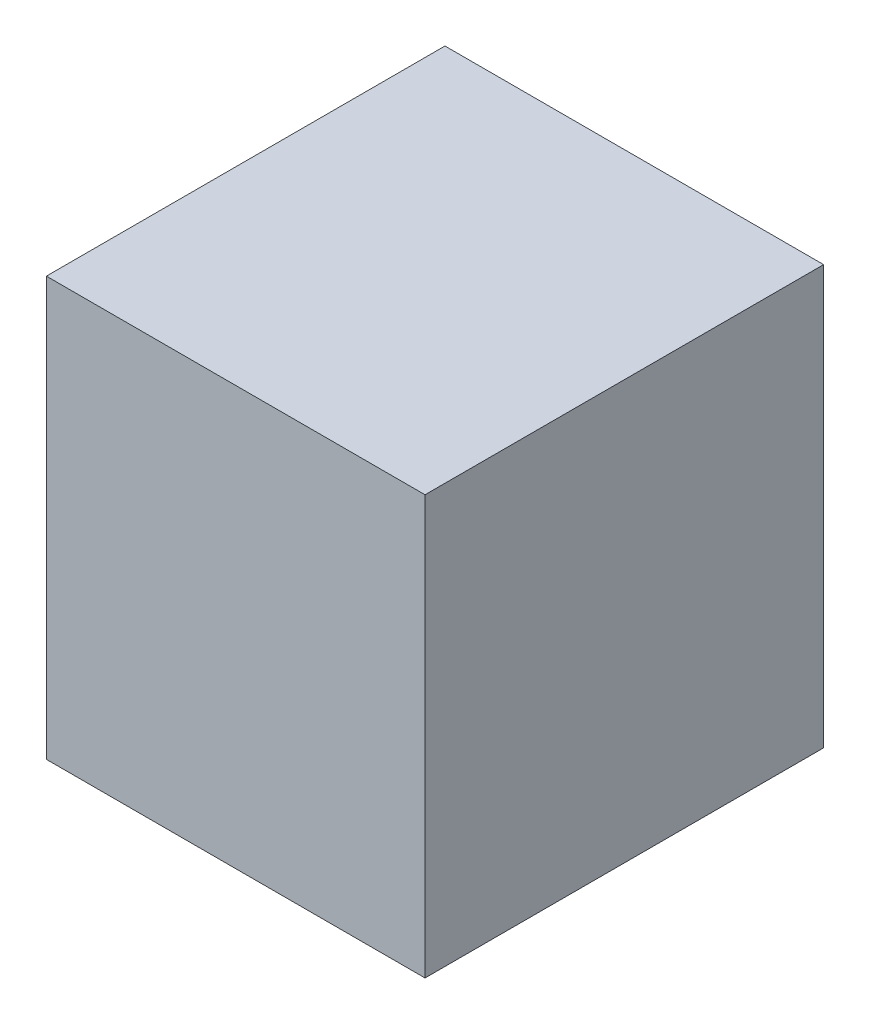
ISO-10303-21;
HEADER;
FILE_DESCRIPTION(('STEP AP214'),'2;1');
FILE_NAME('part.step','',(''),(''),'','','');
FILE_SCHEMA(('AUTOMOTIVE_DESIGN { 1 0 10303 214 1 1 1 1 }'));
ENDSEC;
DATA;
#1=APPLICATION_CONTEXT('core data for automotive mechanical design processes');
#2=APPLICATION_PROTOCOL_DEFINITION('international standard','automotive_design',2000,#1);
#3=PRODUCT_CONTEXT('',#1,'mechanical');
#4=PRODUCT('Part','Part','',(#3));
#5=PRODUCT_RELATED_PRODUCT_CATEGORY('part','',(#4));
#6=PRODUCT_DEFINITION_FORMATION('','',#4);
#7=PRODUCT_DEFINITION_CONTEXT('part definition',#1,'design');
#8=PRODUCT_DEFINITION('design','',#6,#7);
#9=PRODUCT_DEFINITION_SHAPE('','',#8);
#10=(LENGTH_UNIT() NAMED_UNIT(*) SI_UNIT(.MILLI.,.METRE.));
#11=(NAMED_UNIT(*) PLANE_ANGLE_UNIT() SI_UNIT($,.RADIAN.));
#12=(NAMED_UNIT(*) SI_UNIT($,.STERADIAN.) SOLID_ANGLE_UNIT());
#13=UNCERTAINTY_MEASURE_WITH_UNIT(LENGTH_MEASURE(1.E-05),#10,'distance_accuracy_value','');
#14=(GEOMETRIC_REPRESENTATION_CONTEXT(3) GLOBAL_UNCERTAINTY_ASSIGNED_CONTEXT((#13)) GLOBAL_UNIT_ASSIGNED_CONTEXT((#10,
#11,#12)) REPRESENTATION_CONTEXT('',''));
#15=CARTESIAN_POINT('',(0.,0.,0.));
#16=DIRECTION('',(0.,0.,1.));
#17=DIRECTION('',(1.,0.,0.));
#18=AXIS2_PLACEMENT_3D('',#15,#16,#17);
#19=CARTESIAN_POINT('',(0.47500032,0.52499768,0.));
#20=DIRECTION('',(-2.67368955473714E-06,-0.999999999996426,0.));
#21=DIRECTION('',(-0.999999999996426,2.67368955473714E-06,0.));
#22=AXIS2_PLACEMENT_3D('',#19,#20,#21);
#23=PLANE('',#22);
#24=DIRECTION('',(-0.999999999996426,2.67368955473714E-06,0.));
#25=VECTOR('',#24,1.);
#26=CARTESIAN_POINT('',(0.47500032,0.52499768,0.));
#27=LINE('',#26,#25);
#28=CARTESIAN_POINT('',(0.47500032,0.52499768,0.));
#29=VERTEX_POINT('',#28);
#30=CARTESIAN_POINT('',(-0.47499778,0.52500022,0.));
#31=VERTEX_POINT('',#30);
#32=EDGE_CURVE('E11',#29,#31,#27,.T.);
#33=ORIENTED_EDGE('',*,*,#32,.T.);
#34=DIRECTION('',(0.,0.,1.));
#35=VECTOR('',#34,1.);
#36=CARTESIAN_POINT('',(-0.47499778,0.52500022,0.));
#37=LINE('',#36,#35);
#38=CARTESIAN_POINT('',(-0.47499778,0.52500022,1.00000054));
#39=VERTEX_POINT('',#38);
#40=EDGE_CURVE('E23',#31,#39,#37,.T.);
#41=ORIENTED_EDGE('',*,*,#40,.T.);
#42=DIRECTION('',(-0.999999999996426,2.67368955473714E-06,0.));
#43=VECTOR('',#42,1.);
#44=CARTESIAN_POINT('',(0.47500032,0.52499768,1.00000054));
#45=LINE('',#44,#43);
#46=CARTESIAN_POINT('',(0.47500032,0.52499768,1.00000054));
#47=VERTEX_POINT('',#46);
#48=EDGE_CURVE('E86',#47,#39,#45,.T.);
#49=ORIENTED_EDGE('',*,*,#48,.F.);
#50=DIRECTION('',(0.,0.,1.));
#51=VECTOR('',#50,1.);
#52=CARTESIAN_POINT('',(0.47500032,0.52499768,0.));
#53=LINE('',#52,#51);
#54=EDGE_CURVE('E35',#29,#47,#53,.T.);
#55=ORIENTED_EDGE('',*,*,#54,.F.);
#56=EDGE_LOOP('',(#33,#41,#49,#55));
#57=FACE_BOUND('',#56,.T.);
#58=ADVANCED_FACE('F16',(#57),#23,.F.);
#59=CARTESIAN_POINT('',(-0.47499778,0.52500022,0.));
#60=DIRECTION('',(1.,0.,0.));
#61=DIRECTION('',(0.,-1.,0.));
#62=AXIS2_PLACEMENT_3D('',#59,#60,#61);
#63=PLANE('',#62);
#64=DIRECTION('',(0.,-1.,0.));
#65=VECTOR('',#64,1.);
#66=CARTESIAN_POINT('',(-0.47499778,0.52500022,0.));
#67=LINE('',#66,#65);
#68=CARTESIAN_POINT('',(-0.47499778,-0.52500022,0.));
#69=VERTEX_POINT('',#68);
#70=EDGE_CURVE('E83',#31,#69,#67,.T.);
#71=ORIENTED_EDGE('',*,*,#70,.T.);
#72=DIRECTION('',(0.,0.,1.));
#73=VECTOR('',#72,1.);
#74=CARTESIAN_POINT('',(-0.47499778,-0.52500022,0.));
#75=LINE('',#74,#73);
#76=CARTESIAN_POINT('',(-0.47499778,-0.52500022,1.00000054));
#77=VERTEX_POINT('',#76);
#78=EDGE_CURVE('E81',#69,#77,#75,.T.);
#79=ORIENTED_EDGE('',*,*,#78,.T.);
#80=DIRECTION('',(0.,-1.,0.));
#81=VECTOR('',#80,1.);
#82=CARTESIAN_POINT('',(-0.47499778,0.52500022,1.00000054));
#83=LINE('',#82,#81);
#84=EDGE_CURVE('E61',#39,#77,#83,.T.);
#85=ORIENTED_EDGE('',*,*,#84,.F.);
#86=ORIENTED_EDGE('',*,*,#40,.F.);
#87=EDGE_LOOP('',(#71,#79,#85,#86));
#88=FACE_BOUND('',#87,.T.);
#89=ADVANCED_FACE('F88',(#88),#63,.F.);
#90=CARTESIAN_POINT('',(-0.47499778,-0.52500022,0.));
#91=DIRECTION('',(-2.67368955473714E-06,0.999999999996426,0.));
#92=DIRECTION('',(0.999999999996426,2.67368955473714E-06,0.));
#93=AXIS2_PLACEMENT_3D('',#90,#91,#92);
#94=PLANE('',#93);
#95=DIRECTION('',(0.999999999996426,2.67368955473714E-06,0.));
#96=VECTOR('',#95,1.);
#97=CARTESIAN_POINT('',(-0.47499778,-0.52500022,0.));
#98=LINE('',#97,#96);
#99=CARTESIAN_POINT('',(0.47500032,-0.52499768,0.));
#100=VERTEX_POINT('',#99);
#101=EDGE_CURVE('E70',#69,#100,#98,.T.);
#102=ORIENTED_EDGE('',*,*,#101,.T.);
#103=DIRECTION('',(0.,0.,1.));
#104=VECTOR('',#103,1.);
#105=CARTESIAN_POINT('',(0.47500032,-0.52499768,0.));
#106=LINE('',#105,#104);
#107=CARTESIAN_POINT('',(0.47500032,-0.52499768,1.00000054));
#108=VERTEX_POINT('',#107);
#109=EDGE_CURVE('E64',#100,#108,#106,.T.);
#110=ORIENTED_EDGE('',*,*,#109,.T.);
#111=DIRECTION('',(0.999999999996426,2.67368955473714E-06,0.));
#112=VECTOR('',#111,1.);
#113=CARTESIAN_POINT('',(-0.47499778,-0.52500022,1.00000054));
#114=LINE('',#113,#112);
#115=EDGE_CURVE('E56',#77,#108,#114,.T.);
#116=ORIENTED_EDGE('',*,*,#115,.F.);
#117=ORIENTED_EDGE('',*,*,#78,.F.);
#118=EDGE_LOOP('',(#102,#110,#116,#117));
#119=FACE_BOUND('',#118,.T.);
#120=ADVANCED_FACE('F68',(#119),#94,.F.);
#121=CARTESIAN_POINT('',(0.47500032,-0.52499768,0.));
#122=DIRECTION('',(-1.,0.,0.));
#123=DIRECTION('',(0.,1.,0.));
#124=AXIS2_PLACEMENT_3D('',#121,#122,#123);
#125=PLANE('',#124);
#126=DIRECTION('',(0.,1.,0.));
#127=VECTOR('',#126,1.);
#128=CARTESIAN_POINT('',(0.47500032,-0.52499768,0.));
#129=LINE('',#128,#127);
#130=EDGE_CURVE('E65',#100,#29,#129,.T.);
#131=ORIENTED_EDGE('',*,*,#130,.T.);
#132=ORIENTED_EDGE('',*,*,#54,.T.);
#133=DIRECTION('',(0.,1.,0.));
#134=VECTOR('',#133,1.);
#135=CARTESIAN_POINT('',(0.47500032,-0.52499768,1.00000054));
#136=LINE('',#135,#134);
#137=EDGE_CURVE('E60',#108,#47,#136,.T.);
#138=ORIENTED_EDGE('',*,*,#137,.F.);
#139=ORIENTED_EDGE('',*,*,#109,.F.);
#140=EDGE_LOOP('',(#131,#132,#138,#139));
#141=FACE_BOUND('',#140,.T.);
#142=ADVANCED_FACE('F75',(#141),#125,.F.);
#143=CARTESIAN_POINT('',(0.47500032,0.52499768,0.));
#144=DIRECTION('',(0.,0.,-1.));
#145=DIRECTION('',(-1.,0.,0.));
#146=AXIS2_PLACEMENT_3D('',#143,#144,#145);
#147=PLANE('',#146);
#148=ORIENTED_EDGE('',*,*,#130,.F.);
#149=ORIENTED_EDGE('',*,*,#101,.F.);
#150=ORIENTED_EDGE('',*,*,#70,.F.);
#151=ORIENTED_EDGE('',*,*,#32,.F.);
#152=EDGE_LOOP('',(#148,#149,#150,#151));
#153=FACE_BOUND('',#152,.T.);
#154=ADVANCED_FACE('F90',(#153),#147,.T.);
#155=CARTESIAN_POINT('',(0.47500032,0.52499768,1.00000054));
#156=DIRECTION('',(0.,0.,-1.));
#157=DIRECTION('',(-1.,0.,0.));
#158=AXIS2_PLACEMENT_3D('',#155,#156,#157);
#159=PLANE('',#158);
#160=ORIENTED_EDGE('',*,*,#48,.T.);
#161=ORIENTED_EDGE('',*,*,#84,.T.);
#162=ORIENTED_EDGE('',*,*,#115,.T.);
#163=ORIENTED_EDGE('',*,*,#137,.T.);
#164=EDGE_LOOP('',(#160,#161,#162,#163));
#165=FACE_BOUND('',#164,.T.);
#166=ADVANCED_FACE('F58',(#165),#159,.F.);
#167=CLOSED_SHELL('',(#58,#89,#120,#142,#154,#166));
#168=MANIFOLD_SOLID_BREP('B1',#167);
#169=ADVANCED_BREP_SHAPE_REPRESENTATION('',(#18,#168),#14);
#170=SHAPE_DEFINITION_REPRESENTATION(#9,#169);
ENDSEC;
END-ISO-10303-21;
